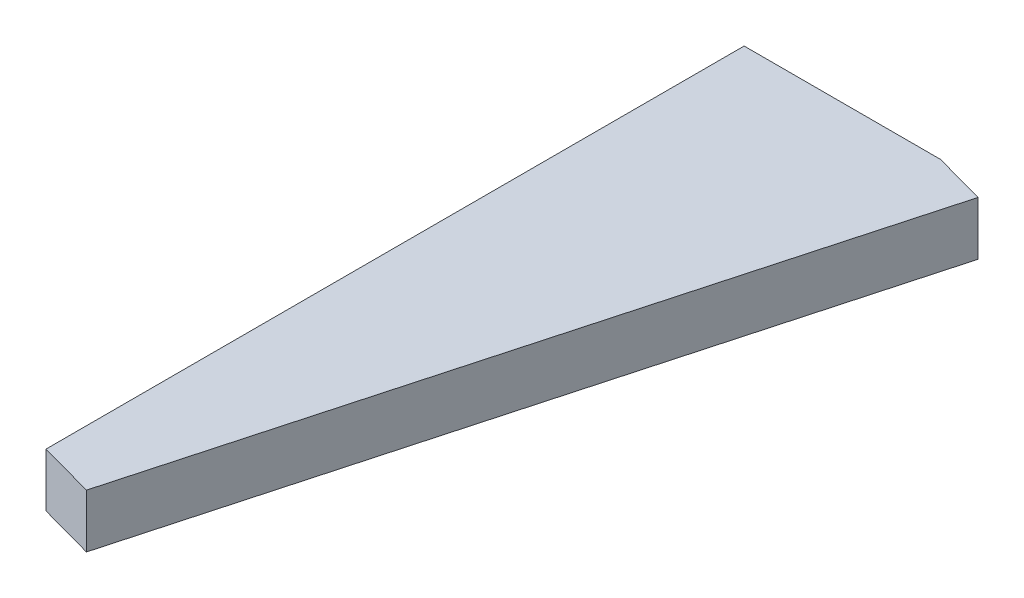
ISO-10303-21;
HEADER;
FILE_DESCRIPTION(('STEP AP214'),'2;1');
FILE_NAME('part.step','',(''),(''),'','','');
FILE_SCHEMA(('AUTOMOTIVE_DESIGN { 1 0 10303 214 1 1 1 1 }'));
ENDSEC;
DATA;
#1=APPLICATION_CONTEXT('core data for automotive mechanical design processes');
#2=APPLICATION_PROTOCOL_DEFINITION('international standard','automotive_design',2000,#1);
#3=PRODUCT_CONTEXT('',#1,'mechanical');
#4=PRODUCT('Part','Part','',(#3));
#5=PRODUCT_RELATED_PRODUCT_CATEGORY('part','',(#4));
#6=PRODUCT_DEFINITION_FORMATION('','',#4);
#7=PRODUCT_DEFINITION_CONTEXT('part definition',#1,'design');
#8=PRODUCT_DEFINITION('design','',#6,#7);
#9=PRODUCT_DEFINITION_SHAPE('','',#8);
#10=(LENGTH_UNIT() NAMED_UNIT(*) SI_UNIT(.MILLI.,.METRE.));
#11=(NAMED_UNIT(*) PLANE_ANGLE_UNIT() SI_UNIT($,.RADIAN.));
#12=(NAMED_UNIT(*) SI_UNIT($,.STERADIAN.) SOLID_ANGLE_UNIT());
#13=UNCERTAINTY_MEASURE_WITH_UNIT(LENGTH_MEASURE(1.E-05),#10,'distance_accuracy_value','');
#14=(GEOMETRIC_REPRESENTATION_CONTEXT(3) GLOBAL_UNCERTAINTY_ASSIGNED_CONTEXT((#13)) GLOBAL_UNIT_ASSIGNED_CONTEXT((#10,
#11,#12)) REPRESENTATION_CONTEXT('',''));
#15=CARTESIAN_POINT('',(0.,0.,0.));
#16=DIRECTION('',(0.,0.,1.));
#17=DIRECTION('',(1.,0.,0.));
#18=AXIS2_PLACEMENT_3D('',#15,#16,#17);
#19=CARTESIAN_POINT('',(13.8926161784114,3.,-39.2045305509369));
#20=DIRECTION('',(0.96420539280379,0.,0.265156483021042));
#21=DIRECTION('',(0.265156483021042,0.,-0.96420539280379));
#22=AXIS2_PLACEMENT_3D('',#19,#20,#21);
#23=PLANE('',#22);
#24=DIRECTION('',(-0.265156483021042,0.,0.96420539280379));
#25=VECTOR('',#24,1.);
#26=CARTESIAN_POINT('',(13.8926161784114,0.,-39.2045305509369));
#27=LINE('',#26,#25);
#28=CARTESIAN_POINT('',(13.8926161784114,0.,-39.2045305509369));
#29=VERTEX_POINT('',#28);
#30=CARTESIAN_POINT('',(3.12330231863968,0.,-0.0433892426761686));
#31=VERTEX_POINT('',#30);
#32=EDGE_CURVE('E113',#29,#31,#27,.T.);
#33=ORIENTED_EDGE('',*,*,#32,.F.);
#34=DIRECTION('',(0.,-1.,0.));
#35=VECTOR('',#34,1.);
#36=CARTESIAN_POINT('',(13.8926161784114,3.,-39.2045305509369));
#37=LINE('',#36,#35);
#38=CARTESIAN_POINT('',(13.8926161784114,3.,-39.2045305509369));
#39=VERTEX_POINT('',#38);
#40=EDGE_CURVE('E11',#39,#29,#37,.T.);
#41=ORIENTED_EDGE('',*,*,#40,.F.);
#42=DIRECTION('',(-0.265156483021042,0.,0.96420539280379));
#43=VECTOR('',#42,1.);
#44=CARTESIAN_POINT('',(13.8926161784114,3.,-39.2045305509369));
#45=LINE('',#44,#43);
#46=CARTESIAN_POINT('',(3.12330231863968,3.,-0.0433892426761686));
#47=VERTEX_POINT('',#46);
#48=EDGE_CURVE('E108',#39,#47,#45,.T.);
#49=ORIENTED_EDGE('',*,*,#48,.T.);
#50=DIRECTION('',(0.,-1.,0.));
#51=VECTOR('',#50,1.);
#52=CARTESIAN_POINT('',(3.12330231863968,3.,-0.0433892426761686));
#53=LINE('',#52,#51);
#54=EDGE_CURVE('E38',#47,#31,#53,.T.);
#55=ORIENTED_EDGE('',*,*,#54,.T.);
#56=EDGE_LOOP('',(#33,#41,#49,#55));
#57=FACE_BOUND('',#56,.T.);
#58=ADVANCED_FACE('F35',(#57),#23,.T.);
#59=CARTESIAN_POINT('',(13.8926161784114,3.,-39.2045305509369));
#60=DIRECTION('',(-0.265156483021042,0.,0.96420539280379));
#61=DIRECTION('',(0.96420539280379,0.,0.265156483021042));
#62=AXIS2_PLACEMENT_3D('',#59,#60,#61);
#63=PLANE('',#62);
#64=DIRECTION('',(-0.96420539280379,0.,-0.265156483021042));
#65=VECTOR('',#64,1.);
#66=CARTESIAN_POINT('',(13.8926161784114,0.,-39.2045305509369));
#67=LINE('',#66,#65);
#68=CARTESIAN_POINT('',(11.,0.,-40.));
#69=VERTEX_POINT('',#68);
#70=EDGE_CURVE('E122',#29,#69,#67,.T.);
#71=ORIENTED_EDGE('',*,*,#70,.T.);
#72=DIRECTION('',(0.,-1.,0.));
#73=VECTOR('',#72,1.);
#74=CARTESIAN_POINT('',(11.,3.,-40.));
#75=LINE('',#74,#73);
#76=CARTESIAN_POINT('',(11.,3.,-40.));
#77=VERTEX_POINT('',#76);
#78=EDGE_CURVE('E44',#77,#69,#75,.T.);
#79=ORIENTED_EDGE('',*,*,#78,.F.);
#80=DIRECTION('',(-0.96420539280379,0.,-0.265156483021042));
#81=VECTOR('',#80,1.);
#82=CARTESIAN_POINT('',(13.8926161784114,3.,-39.2045305509369));
#83=LINE('',#82,#81);
#84=EDGE_CURVE('E103',#39,#77,#83,.T.);
#85=ORIENTED_EDGE('',*,*,#84,.F.);
#86=ORIENTED_EDGE('',*,*,#40,.T.);
#87=EDGE_LOOP('',(#71,#79,#85,#86));
#88=FACE_BOUND('',#87,.T.);
#89=ADVANCED_FACE('F127',(#88),#63,.F.);
#90=CARTESIAN_POINT('',(0.,3.,-40.));
#91=DIRECTION('',(0.,0.,-1.));
#92=DIRECTION('',(-1.,0.,0.));
#93=AXIS2_PLACEMENT_3D('',#90,#91,#92);
#94=PLANE('',#93);
#95=DIRECTION('',(1.,0.,0.));
#96=VECTOR('',#95,1.);
#97=CARTESIAN_POINT('',(0.,0.,-40.));
#98=LINE('',#97,#96);
#99=CARTESIAN_POINT('',(0.,0.,-40.));
#100=VERTEX_POINT('',#99);
#101=EDGE_CURVE('E91',#100,#69,#98,.T.);
#102=ORIENTED_EDGE('',*,*,#101,.F.);
#103=DIRECTION('',(0.,-1.,0.));
#104=VECTOR('',#103,1.);
#105=CARTESIAN_POINT('',(0.,3.,-40.));
#106=LINE('',#105,#104);
#107=CARTESIAN_POINT('',(0.,3.,-40.));
#108=VERTEX_POINT('',#107);
#109=EDGE_CURVE('E86',#108,#100,#106,.T.);
#110=ORIENTED_EDGE('',*,*,#109,.F.);
#111=DIRECTION('',(1.,0.,0.));
#112=VECTOR('',#111,1.);
#113=CARTESIAN_POINT('',(0.,3.,-40.));
#114=LINE('',#113,#112);
#115=EDGE_CURVE('E89',#108,#77,#114,.T.);
#116=ORIENTED_EDGE('',*,*,#115,.T.);
#117=ORIENTED_EDGE('',*,*,#78,.T.);
#118=EDGE_LOOP('',(#102,#110,#116,#117));
#119=FACE_BOUND('',#118,.T.);
#120=ADVANCED_FACE('F88',(#119),#94,.T.);
#121=CARTESIAN_POINT('',(0.,3.,-0.902297380302093));
#122=DIRECTION('',(-1.,0.,0.));
#123=DIRECTION('',(0.,0.,1.));
#124=AXIS2_PLACEMENT_3D('',#121,#122,#123);
#125=PLANE('',#124);
#126=DIRECTION('',(0.,0.,-1.));
#127=VECTOR('',#126,1.);
#128=CARTESIAN_POINT('',(0.,0.,-0.902297380302093));
#129=LINE('',#128,#127);
#130=CARTESIAN_POINT('',(0.,0.,-0.902297380302093));
#131=VERTEX_POINT('',#130);
#132=EDGE_CURVE('E119',#131,#100,#129,.T.);
#133=ORIENTED_EDGE('',*,*,#132,.F.);
#134=DIRECTION('',(0.,-1.,0.));
#135=VECTOR('',#134,1.);
#136=CARTESIAN_POINT('',(0.,3.,-0.902297380302093));
#137=LINE('',#136,#135);
#138=CARTESIAN_POINT('',(0.,3.,-0.902297380302093));
#139=VERTEX_POINT('',#138);
#140=EDGE_CURVE('E96',#139,#131,#137,.T.);
#141=ORIENTED_EDGE('',*,*,#140,.F.);
#142=DIRECTION('',(0.,0.,-1.));
#143=VECTOR('',#142,1.);
#144=CARTESIAN_POINT('',(0.,3.,-0.902297380302093));
#145=LINE('',#144,#143);
#146=EDGE_CURVE('E102',#139,#108,#145,.T.);
#147=ORIENTED_EDGE('',*,*,#146,.T.);
#148=ORIENTED_EDGE('',*,*,#109,.T.);
#149=EDGE_LOOP('',(#133,#141,#147,#148));
#150=FACE_BOUND('',#149,.T.);
#151=ADVANCED_FACE('F105',(#150),#125,.T.);
#152=CARTESIAN_POINT('',(3.12330231863968,3.,-0.0433892426761686));
#153=DIRECTION('',(-0.265156483021046,0.,0.964205392803789));
#154=DIRECTION('',(0.96420539280379,0.,0.265156483021046));
#155=AXIS2_PLACEMENT_3D('',#152,#153,#154);
#156=PLANE('',#155);
#157=DIRECTION('',(-0.964205392803789,0.,-0.265156483021046));
#158=VECTOR('',#157,1.);
#159=CARTESIAN_POINT('',(3.12330231863968,0.,-0.0433892426761686));
#160=LINE('',#159,#158);
#161=EDGE_CURVE('E116',#31,#131,#160,.T.);
#162=ORIENTED_EDGE('',*,*,#161,.F.);
#163=ORIENTED_EDGE('',*,*,#54,.F.);
#164=DIRECTION('',(-0.964205392803789,0.,-0.265156483021046));
#165=VECTOR('',#164,1.);
#166=CARTESIAN_POINT('',(3.12330231863968,3.,-0.0433892426761686));
#167=LINE('',#166,#165);
#168=EDGE_CURVE('E106',#47,#139,#167,.T.);
#169=ORIENTED_EDGE('',*,*,#168,.T.);
#170=ORIENTED_EDGE('',*,*,#140,.T.);
#171=EDGE_LOOP('',(#162,#163,#169,#170));
#172=FACE_BOUND('',#171,.T.);
#173=ADVANCED_FACE('F124',(#172),#156,.T.);
#174=CARTESIAN_POINT('',(0.,3.,0.));
#175=DIRECTION('',(0.,-1.,0.));
#176=DIRECTION('',(0.,0.,-1.));
#177=AXIS2_PLACEMENT_3D('',#174,#175,#176);
#178=PLANE('',#177);
#179=ORIENTED_EDGE('',*,*,#48,.F.);
#180=ORIENTED_EDGE('',*,*,#84,.T.);
#181=ORIENTED_EDGE('',*,*,#115,.F.);
#182=ORIENTED_EDGE('',*,*,#146,.F.);
#183=ORIENTED_EDGE('',*,*,#168,.F.);
#184=EDGE_LOOP('',(#179,#180,#181,#182,#183));
#185=FACE_BOUND('',#184,.T.);
#186=ADVANCED_FACE('F101',(#185),#178,.F.);
#187=CARTESIAN_POINT('',(0.,0.,0.));
#188=DIRECTION('',(0.,-1.,0.));
#189=DIRECTION('',(0.,0.,-1.));
#190=AXIS2_PLACEMENT_3D('',#187,#188,#189);
#191=PLANE('',#190);
#192=ORIENTED_EDGE('',*,*,#32,.T.);
#193=ORIENTED_EDGE('',*,*,#161,.T.);
#194=ORIENTED_EDGE('',*,*,#132,.T.);
#195=ORIENTED_EDGE('',*,*,#101,.T.);
#196=ORIENTED_EDGE('',*,*,#70,.F.);
#197=EDGE_LOOP('',(#192,#193,#194,#195,#196));
#198=FACE_BOUND('',#197,.T.);
#199=ADVANCED_FACE('F126',(#198),#191,.T.);
#200=CLOSED_SHELL('',(#58,#89,#120,#151,#173,#186,#199));
#201=MANIFOLD_SOLID_BREP('B2',#200);
#202=ADVANCED_BREP_SHAPE_REPRESENTATION('',(#18,#201),#14);
#203=SHAPE_DEFINITION_REPRESENTATION(#9,#202);
ENDSEC;
END-ISO-10303-21;
